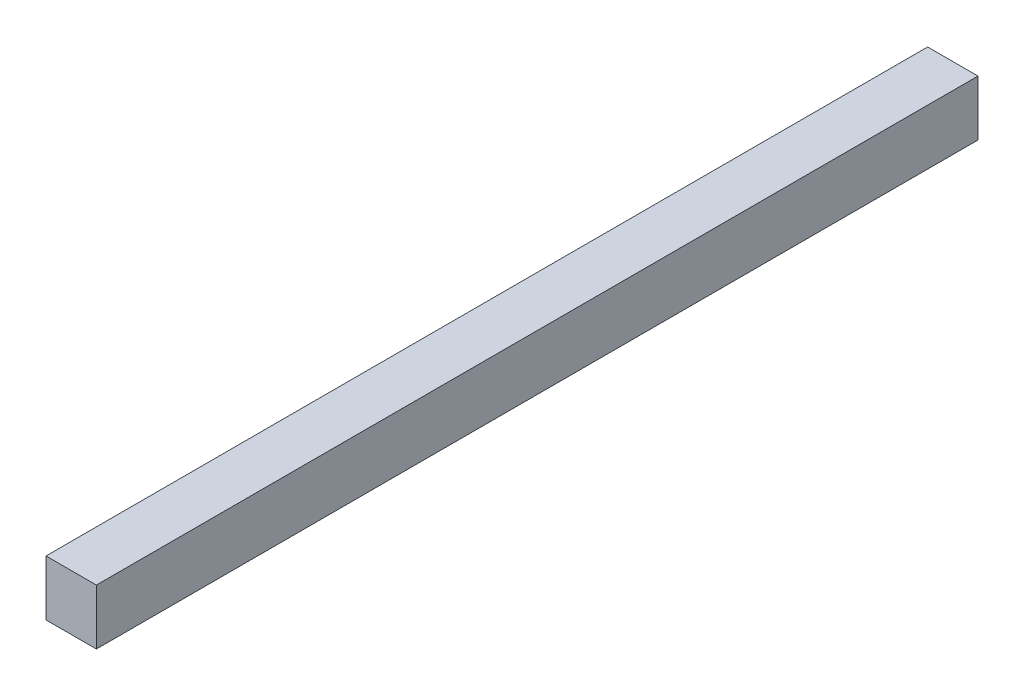
ISO-10303-21;
HEADER;
FILE_DESCRIPTION(('STEP AP214'),'2;1');
FILE_NAME('part.step','',(''),(''),'','','');
FILE_SCHEMA(('AUTOMOTIVE_DESIGN { 1 0 10303 214 1 1 1 1 }'));
ENDSEC;
DATA;
#1=APPLICATION_CONTEXT('core data for automotive mechanical design processes');
#2=APPLICATION_PROTOCOL_DEFINITION('international standard','automotive_design',2000,#1);
#3=PRODUCT_CONTEXT('',#1,'mechanical');
#4=PRODUCT('Part','Part','',(#3));
#5=PRODUCT_RELATED_PRODUCT_CATEGORY('part','',(#4));
#6=PRODUCT_DEFINITION_FORMATION('','',#4);
#7=PRODUCT_DEFINITION_CONTEXT('part definition',#1,'design');
#8=PRODUCT_DEFINITION('design','',#6,#7);
#9=PRODUCT_DEFINITION_SHAPE('','',#8);
#10=(LENGTH_UNIT() NAMED_UNIT(*) SI_UNIT(.MILLI.,.METRE.));
#11=(NAMED_UNIT(*) PLANE_ANGLE_UNIT() SI_UNIT($,.RADIAN.));
#12=(NAMED_UNIT(*) SI_UNIT($,.STERADIAN.) SOLID_ANGLE_UNIT());
#13=UNCERTAINTY_MEASURE_WITH_UNIT(LENGTH_MEASURE(1.E-05),#10,'distance_accuracy_value','');
#14=(GEOMETRIC_REPRESENTATION_CONTEXT(3) GLOBAL_UNCERTAINTY_ASSIGNED_CONTEXT((#13)) GLOBAL_UNIT_ASSIGNED_CONTEXT((#10,
#11,#12)) REPRESENTATION_CONTEXT('',''));
#15=CARTESIAN_POINT('',(0.,0.,0.));
#16=DIRECTION('',(0.,0.,1.));
#17=DIRECTION('',(1.,0.,0.));
#18=AXIS2_PLACEMENT_3D('',#15,#16,#17);
#19=CARTESIAN_POINT('',(0.,0.,35.));
#20=DIRECTION('',(1.,0.,0.));
#21=DIRECTION('',(0.,1.,0.));
#22=AXIS2_PLACEMENT_3D('',#19,#20,#21);
#23=PLANE('',#22);
#24=DIRECTION('',(0.,-1.,0.));
#25=VECTOR('',#24,1.);
#26=CARTESIAN_POINT('',(0.,0.,0.));
#27=LINE('',#26,#25);
#28=CARTESIAN_POINT('',(0.,0.,0.));
#29=VERTEX_POINT('',#28);
#30=CARTESIAN_POINT('',(0.,-2.2,0.));
#31=VERTEX_POINT('',#30);
#32=EDGE_CURVE('E107',#29,#31,#27,.T.);
#33=ORIENTED_EDGE('',*,*,#32,.T.);
#34=DIRECTION('',(0.,0.,-1.));
#35=VECTOR('',#34,1.);
#36=CARTESIAN_POINT('',(0.,-2.2,35.));
#37=LINE('',#36,#35);
#38=CARTESIAN_POINT('',(0.,-2.2,35.));
#39=VERTEX_POINT('',#38);
#40=EDGE_CURVE('E11',#39,#31,#37,.T.);
#41=ORIENTED_EDGE('',*,*,#40,.F.);
#42=DIRECTION('',(0.,-1.,0.));
#43=VECTOR('',#42,1.);
#44=CARTESIAN_POINT('',(0.,0.,35.));
#45=LINE('',#44,#43);
#46=CARTESIAN_POINT('',(0.,0.,35.));
#47=VERTEX_POINT('',#46);
#48=EDGE_CURVE('E91',#47,#39,#45,.T.);
#49=ORIENTED_EDGE('',*,*,#48,.F.);
#50=DIRECTION('',(0.,0.,-1.));
#51=VECTOR('',#50,1.);
#52=CARTESIAN_POINT('',(0.,0.,35.));
#53=LINE('',#52,#51);
#54=EDGE_CURVE('E103',#47,#29,#53,.T.);
#55=ORIENTED_EDGE('',*,*,#54,.T.);
#56=EDGE_LOOP('',(#33,#41,#49,#55));
#57=FACE_BOUND('',#56,.T.);
#58=ADVANCED_FACE('F39',(#57),#23,.F.);
#59=CARTESIAN_POINT('',(0.,-2.2,35.));
#60=DIRECTION('',(0.,1.,0.));
#61=DIRECTION('',(0.,0.,1.));
#62=AXIS2_PLACEMENT_3D('',#59,#60,#61);
#63=PLANE('',#62);
#64=DIRECTION('',(1.,0.,0.));
#65=VECTOR('',#64,1.);
#66=CARTESIAN_POINT('',(0.,-2.2,0.));
#67=LINE('',#66,#65);
#68=CARTESIAN_POINT('',(2.,-2.2,0.));
#69=VERTEX_POINT('',#68);
#70=EDGE_CURVE('E96',#31,#69,#67,.T.);
#71=ORIENTED_EDGE('',*,*,#70,.T.);
#72=DIRECTION('',(0.,0.,-1.));
#73=VECTOR('',#72,1.);
#74=CARTESIAN_POINT('',(2.,-2.2,35.));
#75=LINE('',#74,#73);
#76=CARTESIAN_POINT('',(2.,-2.2,35.));
#77=VERTEX_POINT('',#76);
#78=EDGE_CURVE('E48',#77,#69,#75,.T.);
#79=ORIENTED_EDGE('',*,*,#78,.F.);
#80=DIRECTION('',(1.,0.,0.));
#81=VECTOR('',#80,1.);
#82=CARTESIAN_POINT('',(0.,-2.2,35.));
#83=LINE('',#82,#81);
#84=EDGE_CURVE('E86',#39,#77,#83,.T.);
#85=ORIENTED_EDGE('',*,*,#84,.F.);
#86=ORIENTED_EDGE('',*,*,#40,.T.);
#87=EDGE_LOOP('',(#71,#79,#85,#86));
#88=FACE_BOUND('',#87,.T.);
#89=ADVANCED_FACE('F95',(#88),#63,.F.);
#90=CARTESIAN_POINT('',(2.,0.,35.));
#91=DIRECTION('',(-1.,0.,0.));
#92=DIRECTION('',(0.,-1.,0.));
#93=AXIS2_PLACEMENT_3D('',#90,#91,#92);
#94=PLANE('',#93);
#95=DIRECTION('',(0.,1.,0.));
#96=VECTOR('',#95,1.);
#97=CARTESIAN_POINT('',(2.,0.,0.));
#98=LINE('',#97,#96);
#99=CARTESIAN_POINT('',(2.,0.,0.));
#100=VERTEX_POINT('',#99);
#101=EDGE_CURVE('E73',#69,#100,#98,.T.);
#102=ORIENTED_EDGE('',*,*,#101,.T.);
#103=DIRECTION('',(0.,0.,-1.));
#104=VECTOR('',#103,1.);
#105=CARTESIAN_POINT('',(2.,0.,35.));
#106=LINE('',#105,#104);
#107=CARTESIAN_POINT('',(2.,0.,35.));
#108=VERTEX_POINT('',#107);
#109=EDGE_CURVE('E98',#108,#100,#106,.T.);
#110=ORIENTED_EDGE('',*,*,#109,.F.);
#111=DIRECTION('',(0.,1.,0.));
#112=VECTOR('',#111,1.);
#113=CARTESIAN_POINT('',(2.,0.,35.));
#114=LINE('',#113,#112);
#115=EDGE_CURVE('E89',#77,#108,#114,.T.);
#116=ORIENTED_EDGE('',*,*,#115,.F.);
#117=ORIENTED_EDGE('',*,*,#78,.T.);
#118=EDGE_LOOP('',(#102,#110,#116,#117));
#119=FACE_BOUND('',#118,.T.);
#120=ADVANCED_FACE('F99',(#119),#94,.F.);
#121=CARTESIAN_POINT('',(0.,0.,35.));
#122=DIRECTION('',(0.,-1.,0.));
#123=DIRECTION('',(0.,0.,-1.));
#124=AXIS2_PLACEMENT_3D('',#121,#122,#123);
#125=PLANE('',#124);
#126=DIRECTION('',(-1.,0.,0.));
#127=VECTOR('',#126,1.);
#128=CARTESIAN_POINT('',(0.,0.,0.));
#129=LINE('',#128,#127);
#130=EDGE_CURVE('E79',#100,#29,#129,.T.);
#131=ORIENTED_EDGE('',*,*,#130,.T.);
#132=ORIENTED_EDGE('',*,*,#54,.F.);
#133=DIRECTION('',(-1.,0.,0.));
#134=VECTOR('',#133,1.);
#135=CARTESIAN_POINT('',(0.,0.,35.));
#136=LINE('',#135,#134);
#137=EDGE_CURVE('E56',#108,#47,#136,.T.);
#138=ORIENTED_EDGE('',*,*,#137,.F.);
#139=ORIENTED_EDGE('',*,*,#109,.T.);
#140=EDGE_LOOP('',(#131,#132,#138,#139));
#141=FACE_BOUND('',#140,.T.);
#142=ADVANCED_FACE('F120',(#141),#125,.F.);
#143=CARTESIAN_POINT('',(0.,0.,35.));
#144=DIRECTION('',(0.,0.,1.));
#145=DIRECTION('',(1.,0.,0.));
#146=AXIS2_PLACEMENT_3D('',#143,#144,#145);
#147=PLANE('',#146);
#148=ORIENTED_EDGE('',*,*,#48,.T.);
#149=ORIENTED_EDGE('',*,*,#84,.T.);
#150=ORIENTED_EDGE('',*,*,#115,.T.);
#151=ORIENTED_EDGE('',*,*,#137,.T.);
#152=EDGE_LOOP('',(#148,#149,#150,#151));
#153=FACE_BOUND('',#152,.T.);
#154=ADVANCED_FACE('F87',(#153),#147,.T.);
#155=CARTESIAN_POINT('',(0.,0.,0.));
#156=DIRECTION('',(0.,0.,1.));
#157=DIRECTION('',(1.,0.,0.));
#158=AXIS2_PLACEMENT_3D('',#155,#156,#157);
#159=PLANE('',#158);
#160=ORIENTED_EDGE('',*,*,#32,.F.);
#161=ORIENTED_EDGE('',*,*,#130,.F.);
#162=ORIENTED_EDGE('',*,*,#101,.F.);
#163=ORIENTED_EDGE('',*,*,#70,.F.);
#164=EDGE_LOOP('',(#160,#161,#162,#163));
#165=FACE_BOUND('',#164,.T.);
#166=ADVANCED_FACE('F123',(#165),#159,.F.);
#167=CLOSED_SHELL('',(#58,#89,#120,#142,#154,#166));
#168=MANIFOLD_SOLID_BREP('B2',#167);
#169=ADVANCED_BREP_SHAPE_REPRESENTATION('',(#18,#168),#14);
#170=SHAPE_DEFINITION_REPRESENTATION(#9,#169);
ENDSEC;
END-ISO-10303-21;
